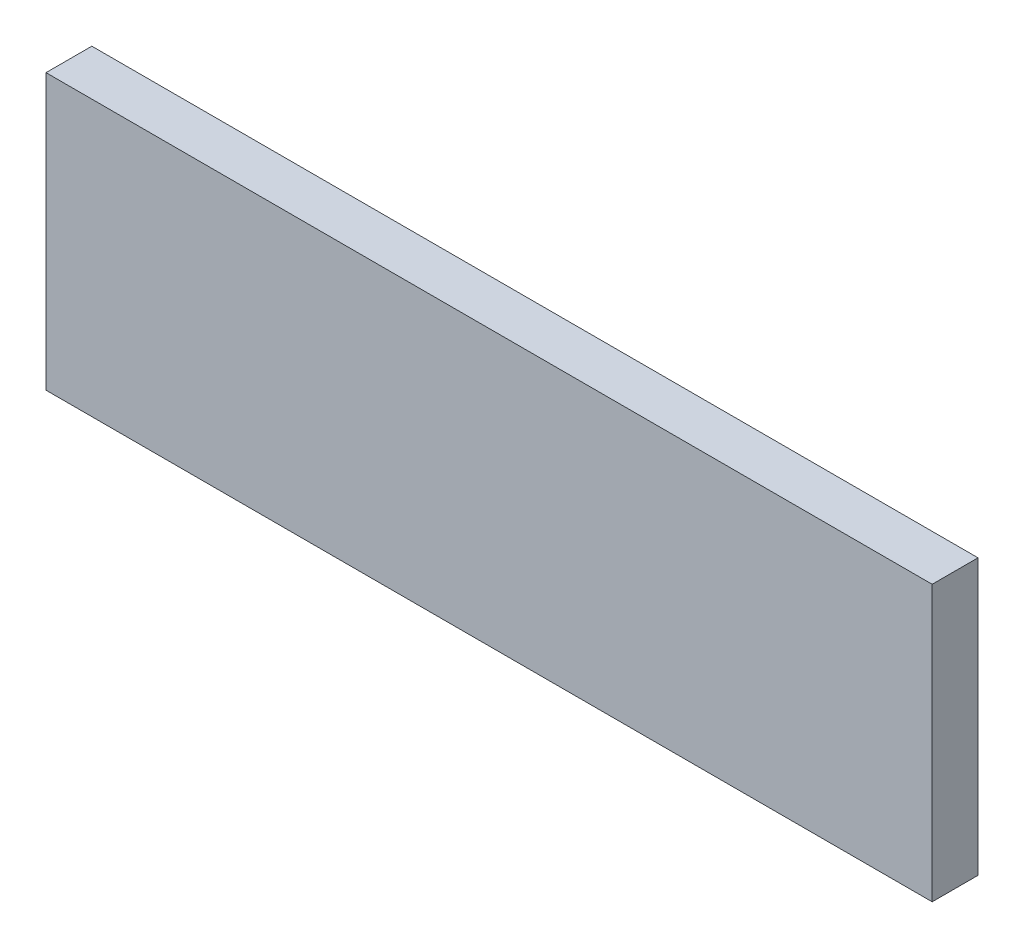
ISO-10303-21;
HEADER;
FILE_DESCRIPTION(('STEP AP214'),'2;1');
FILE_NAME('part.step','',(''),(''),'','','');
FILE_SCHEMA(('AUTOMOTIVE_DESIGN { 1 0 10303 214 1 1 1 1 }'));
ENDSEC;
DATA;
#1=APPLICATION_CONTEXT('core data for automotive mechanical design processes');
#2=APPLICATION_PROTOCOL_DEFINITION('international standard','automotive_design',2000,#1);
#3=PRODUCT_CONTEXT('',#1,'mechanical');
#4=PRODUCT('Part','Part','',(#3));
#5=PRODUCT_RELATED_PRODUCT_CATEGORY('part','',(#4));
#6=PRODUCT_DEFINITION_FORMATION('','',#4);
#7=PRODUCT_DEFINITION_CONTEXT('part definition',#1,'design');
#8=PRODUCT_DEFINITION('design','',#6,#7);
#9=PRODUCT_DEFINITION_SHAPE('','',#8);
#10=(LENGTH_UNIT() NAMED_UNIT(*) SI_UNIT(.MILLI.,.METRE.));
#11=(NAMED_UNIT(*) PLANE_ANGLE_UNIT() SI_UNIT($,.RADIAN.));
#12=(NAMED_UNIT(*) SI_UNIT($,.STERADIAN.) SOLID_ANGLE_UNIT());
#13=UNCERTAINTY_MEASURE_WITH_UNIT(LENGTH_MEASURE(1.E-05),#10,'distance_accuracy_value','');
#14=(GEOMETRIC_REPRESENTATION_CONTEXT(3) GLOBAL_UNCERTAINTY_ASSIGNED_CONTEXT((#13)) GLOBAL_UNIT_ASSIGNED_CONTEXT((#10,
#11,#12)) REPRESENTATION_CONTEXT('',''));
#15=CARTESIAN_POINT('',(0.,0.,0.));
#16=DIRECTION('',(0.,0.,1.));
#17=DIRECTION('',(1.,0.,0.));
#18=AXIS2_PLACEMENT_3D('',#15,#16,#17);
#19=CARTESIAN_POINT('',(368.3,-57.15,-9.52500000000001));
#20=DIRECTION('',(0.,0.,1.));
#21=DIRECTION('',(1.,0.,0.));
#22=AXIS2_PLACEMENT_3D('',#19,#20,#21);
#23=PLANE('',#22);
#24=DIRECTION('',(0.,1.,0.));
#25=VECTOR('',#24,1.);
#26=CARTESIAN_POINT('',(0.,-57.15,-9.52500000000001));
#27=LINE('',#26,#25);
#28=CARTESIAN_POINT('',(0.,-57.15,-9.52500000000001));
#29=VERTEX_POINT('',#28);
#30=CARTESIAN_POINT('',(0.,57.15,-9.52500000000001));
#31=VERTEX_POINT('',#30);
#32=EDGE_CURVE('E104',#29,#31,#27,.T.);
#33=ORIENTED_EDGE('',*,*,#32,.T.);
#34=DIRECTION('',(-1.,0.,0.));
#35=VECTOR('',#34,1.);
#36=CARTESIAN_POINT('',(368.3,57.15,-9.52500000000001));
#37=LINE('',#36,#35);
#38=CARTESIAN_POINT('',(368.3,57.15,-9.52500000000001));
#39=VERTEX_POINT('',#38);
#40=EDGE_CURVE('E11',#39,#31,#37,.T.);
#41=ORIENTED_EDGE('',*,*,#40,.F.);
#42=DIRECTION('',(0.,1.,0.));
#43=VECTOR('',#42,1.);
#44=CARTESIAN_POINT('',(368.3,-57.15,-9.52500000000001));
#45=LINE('',#44,#43);
#46=CARTESIAN_POINT('',(368.3,-57.15,-9.52500000000001));
#47=VERTEX_POINT('',#46);
#48=EDGE_CURVE('E92',#47,#39,#45,.T.);
#49=ORIENTED_EDGE('',*,*,#48,.F.);
#50=DIRECTION('',(-1.,0.,0.));
#51=VECTOR('',#50,1.);
#52=CARTESIAN_POINT('',(368.3,-57.15,-9.52500000000001));
#53=LINE('',#52,#51);
#54=EDGE_CURVE('E100',#47,#29,#53,.T.);
#55=ORIENTED_EDGE('',*,*,#54,.T.);
#56=EDGE_LOOP('',(#33,#41,#49,#55));
#57=FACE_BOUND('',#56,.T.);
#58=ADVANCED_FACE('F41',(#57),#23,.F.);
#59=CARTESIAN_POINT('',(368.3,57.15,9.52500000000001));
#60=DIRECTION('',(0.,-1.,0.));
#61=DIRECTION('',(0.,0.,-1.));
#62=AXIS2_PLACEMENT_3D('',#59,#60,#61);
#63=PLANE('',#62);
#64=DIRECTION('',(0.,0.,1.));
#65=VECTOR('',#64,1.);
#66=CARTESIAN_POINT('',(0.,57.15,9.52500000000001));
#67=LINE('',#66,#65);
#68=CARTESIAN_POINT('',(0.,57.15,9.52500000000001));
#69=VERTEX_POINT('',#68);
#70=EDGE_CURVE('E96',#31,#69,#67,.T.);
#71=ORIENTED_EDGE('',*,*,#70,.T.);
#72=DIRECTION('',(-1.,0.,0.));
#73=VECTOR('',#72,1.);
#74=CARTESIAN_POINT('',(368.3,57.15,9.52500000000001));
#75=LINE('',#74,#73);
#76=CARTESIAN_POINT('',(368.3,57.15,9.52500000000001));
#77=VERTEX_POINT('',#76);
#78=EDGE_CURVE('E49',#77,#69,#75,.T.);
#79=ORIENTED_EDGE('',*,*,#78,.F.);
#80=DIRECTION('',(0.,0.,1.));
#81=VECTOR('',#80,1.);
#82=CARTESIAN_POINT('',(368.3,57.15,9.52500000000001));
#83=LINE('',#82,#81);
#84=EDGE_CURVE('E87',#39,#77,#83,.T.);
#85=ORIENTED_EDGE('',*,*,#84,.F.);
#86=ORIENTED_EDGE('',*,*,#40,.T.);
#87=EDGE_LOOP('',(#71,#79,#85,#86));
#88=FACE_BOUND('',#87,.T.);
#89=ADVANCED_FACE('F95',(#88),#63,.F.);
#90=CARTESIAN_POINT('',(368.3,-57.15,9.52500000000001));
#91=DIRECTION('',(0.,0.,-1.));
#92=DIRECTION('',(-1.,0.,0.));
#93=AXIS2_PLACEMENT_3D('',#90,#91,#92);
#94=PLANE('',#93);
#95=DIRECTION('',(0.,-1.,0.));
#96=VECTOR('',#95,1.);
#97=CARTESIAN_POINT('',(0.,-57.15,9.52500000000001));
#98=LINE('',#97,#96);
#99=CARTESIAN_POINT('',(0.,-57.15,9.52500000000001));
#100=VERTEX_POINT('',#99);
#101=EDGE_CURVE('E74',#69,#100,#98,.T.);
#102=ORIENTED_EDGE('',*,*,#101,.T.);
#103=DIRECTION('',(-1.,0.,0.));
#104=VECTOR('',#103,1.);
#105=CARTESIAN_POINT('',(368.3,-57.15,9.52500000000001));
#106=LINE('',#105,#104);
#107=CARTESIAN_POINT('',(368.3,-57.15,9.52500000000001));
#108=VERTEX_POINT('',#107);
#109=EDGE_CURVE('E97',#108,#100,#106,.T.);
#110=ORIENTED_EDGE('',*,*,#109,.F.);
#111=DIRECTION('',(0.,-1.,0.));
#112=VECTOR('',#111,1.);
#113=CARTESIAN_POINT('',(368.3,-57.15,9.52500000000001));
#114=LINE('',#113,#112);
#115=EDGE_CURVE('E90',#77,#108,#114,.T.);
#116=ORIENTED_EDGE('',*,*,#115,.F.);
#117=ORIENTED_EDGE('',*,*,#78,.T.);
#118=EDGE_LOOP('',(#102,#110,#116,#117));
#119=FACE_BOUND('',#118,.T.);
#120=ADVANCED_FACE('F98',(#119),#94,.F.);
#121=CARTESIAN_POINT('',(368.3,-57.15,9.52500000000001));
#122=DIRECTION('',(0.,1.,0.));
#123=DIRECTION('',(0.,0.,1.));
#124=AXIS2_PLACEMENT_3D('',#121,#122,#123);
#125=PLANE('',#124);
#126=DIRECTION('',(0.,0.,-1.));
#127=VECTOR('',#126,1.);
#128=CARTESIAN_POINT('',(0.,-57.15,9.52500000000001));
#129=LINE('',#128,#127);
#130=EDGE_CURVE('E80',#100,#29,#129,.T.);
#131=ORIENTED_EDGE('',*,*,#130,.T.);
#132=ORIENTED_EDGE('',*,*,#54,.F.);
#133=DIRECTION('',(0.,0.,-1.));
#134=VECTOR('',#133,1.);
#135=CARTESIAN_POINT('',(368.3,-57.15,9.52500000000001));
#136=LINE('',#135,#134);
#137=EDGE_CURVE('E57',#108,#47,#136,.T.);
#138=ORIENTED_EDGE('',*,*,#137,.F.);
#139=ORIENTED_EDGE('',*,*,#109,.T.);
#140=EDGE_LOOP('',(#131,#132,#138,#139));
#141=FACE_BOUND('',#140,.T.);
#142=ADVANCED_FACE('F111',(#141),#125,.F.);
#143=CARTESIAN_POINT('',(368.3,0.,0.));
#144=DIRECTION('',(-1.,0.,0.));
#145=DIRECTION('',(0.,0.,1.));
#146=AXIS2_PLACEMENT_3D('',#143,#144,#145);
#147=PLANE('',#146);
#148=ORIENTED_EDGE('',*,*,#48,.T.);
#149=ORIENTED_EDGE('',*,*,#84,.T.);
#150=ORIENTED_EDGE('',*,*,#115,.T.);
#151=ORIENTED_EDGE('',*,*,#137,.T.);
#152=EDGE_LOOP('',(#148,#149,#150,#151));
#153=FACE_BOUND('',#152,.T.);
#154=ADVANCED_FACE('F88',(#153),#147,.F.);
#155=CARTESIAN_POINT('',(0.,0.,0.));
#156=DIRECTION('',(-1.,0.,0.));
#157=DIRECTION('',(0.,0.,1.));
#158=AXIS2_PLACEMENT_3D('',#155,#156,#157);
#159=PLANE('',#158);
#160=ORIENTED_EDGE('',*,*,#32,.F.);
#161=ORIENTED_EDGE('',*,*,#130,.F.);
#162=ORIENTED_EDGE('',*,*,#101,.F.);
#163=ORIENTED_EDGE('',*,*,#70,.F.);
#164=EDGE_LOOP('',(#160,#161,#162,#163));
#165=FACE_BOUND('',#164,.T.);
#166=ADVANCED_FACE('F114',(#165),#159,.T.);
#167=CLOSED_SHELL('',(#58,#89,#120,#142,#154,#166));
#168=MANIFOLD_SOLID_BREP('B2',#167);
#169=ADVANCED_BREP_SHAPE_REPRESENTATION('',(#18,#168),#14);
#170=SHAPE_DEFINITION_REPRESENTATION(#9,#169);
ENDSEC;
END-ISO-10303-21;
